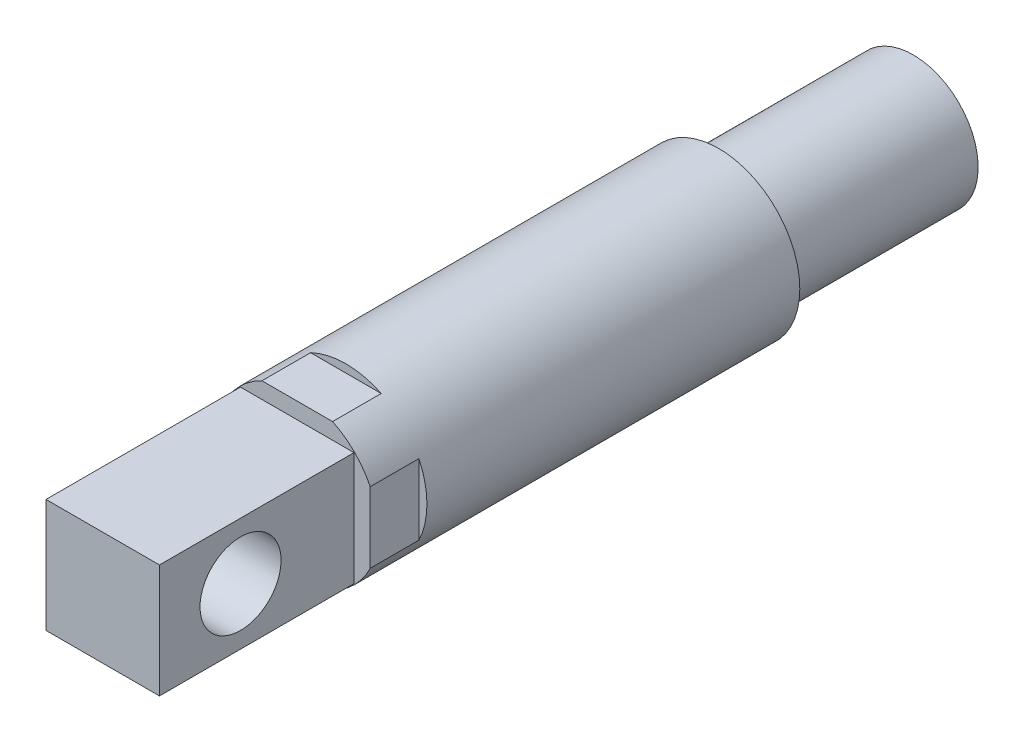
ISO-10303-21;
HEADER;
FILE_DESCRIPTION(('STEP AP214'),'2;1');
FILE_NAME('part.step','',(''),(''),'','','');
FILE_SCHEMA(('AUTOMOTIVE_DESIGN { 1 0 10303 214 1 1 1 1 }'));
ENDSEC;
DATA;
#1=APPLICATION_CONTEXT('core data for automotive mechanical design processes');
#2=APPLICATION_PROTOCOL_DEFINITION('international standard','automotive_design',2000,#1);
#3=PRODUCT_CONTEXT('',#1,'mechanical');
#4=PRODUCT('Part','Part','',(#3));
#5=PRODUCT_RELATED_PRODUCT_CATEGORY('part','',(#4));
#6=PRODUCT_DEFINITION_FORMATION('','',#4);
#7=PRODUCT_DEFINITION_CONTEXT('part definition',#1,'design');
#8=PRODUCT_DEFINITION('design','',#6,#7);
#9=PRODUCT_DEFINITION_SHAPE('','',#8);
#10=(LENGTH_UNIT() NAMED_UNIT(*) SI_UNIT(.MILLI.,.METRE.));
#11=(NAMED_UNIT(*) PLANE_ANGLE_UNIT() SI_UNIT($,.RADIAN.));
#12=(NAMED_UNIT(*) SI_UNIT($,.STERADIAN.) SOLID_ANGLE_UNIT());
#13=UNCERTAINTY_MEASURE_WITH_UNIT(LENGTH_MEASURE(1.E-05),#10,'distance_accuracy_value','');
#14=(GEOMETRIC_REPRESENTATION_CONTEXT(3) GLOBAL_UNCERTAINTY_ASSIGNED_CONTEXT((#13)) GLOBAL_UNIT_ASSIGNED_CONTEXT((#10,
#11,#12)) REPRESENTATION_CONTEXT('',''));
#15=CARTESIAN_POINT('',(0.,0.,0.));
#16=DIRECTION('',(0.,0.,1.));
#17=DIRECTION('',(1.,0.,0.));
#18=AXIS2_PLACEMENT_3D('',#15,#16,#17);
#19=CARTESIAN_POINT('',(-4.5,-4.5,30.));
#20=DIRECTION('',(0.,-1.,0.));
#21=DIRECTION('',(0.,0.,-1.));
#22=AXIS2_PLACEMENT_3D('',#19,#20,#21);
#23=PLANE('',#22);
#24=DIRECTION('',(0.,0.,-1.));
#25=VECTOR('',#24,1.);
#26=CARTESIAN_POINT('',(2.17944947177034,-4.5,70.));
#27=LINE('',#26,#25);
#28=CARTESIAN_POINT('',(2.17944947177034,-4.5,23.));
#29=VERTEX_POINT('',#28);
#30=CARTESIAN_POINT('',(2.17944947177034,-4.5,26.));
#31=VERTEX_POINT('',#30);
#32=EDGE_CURVE('E488',#29,#31,#27,.F.);
#33=ORIENTED_EDGE('',*,*,#32,.T.);
#34=DIRECTION('',(1.,0.,0.));
#35=VECTOR('',#34,1.);
#36=CARTESIAN_POINT('',(-4.5,-4.5,26.));
#37=LINE('',#36,#35);
#38=CARTESIAN_POINT('',(-2.17944947177034,-4.5,26.));
#39=VERTEX_POINT('',#38);
#40=EDGE_CURVE('E448',#39,#31,#37,.T.);
#41=ORIENTED_EDGE('',*,*,#40,.F.);
#42=DIRECTION('',(0.,0.,-1.));
#43=VECTOR('',#42,1.);
#44=CARTESIAN_POINT('',(-2.17944947177034,-4.5,70.));
#45=LINE('',#44,#43);
#46=CARTESIAN_POINT('',(-2.17944947177034,-4.5,23.));
#47=VERTEX_POINT('',#46);
#48=EDGE_CURVE('E485',#39,#47,#45,.T.);
#49=ORIENTED_EDGE('',*,*,#48,.T.);
#50=DIRECTION('',(1.,0.,0.));
#51=VECTOR('',#50,1.);
#52=CARTESIAN_POINT('',(-4.5,-4.5,23.));
#53=LINE('',#52,#51);
#54=EDGE_CURVE('E463',#47,#29,#53,.T.);
#55=ORIENTED_EDGE('',*,*,#54,.T.);
#56=EDGE_LOOP('',(#33,#41,#49,#55));
#57=FACE_BOUND('',#56,.T.);
#58=ADVANCED_FACE('F291',(#57),#23,.T.);
#59=CARTESIAN_POINT('',(4.5,-4.5,30.));
#60=DIRECTION('',(1.,0.,0.));
#61=DIRECTION('',(0.,0.,-1.));
#62=AXIS2_PLACEMENT_3D('',#59,#60,#61);
#63=PLANE('',#62);
#64=DIRECTION('',(0.,0.,-1.));
#65=VECTOR('',#64,1.);
#66=CARTESIAN_POINT('',(4.5,2.17944947177034,70.));
#67=LINE('',#66,#65);
#68=CARTESIAN_POINT('',(4.5,2.17944947177034,23.));
#69=VERTEX_POINT('',#68);
#70=CARTESIAN_POINT('',(4.5,2.17944947177034,26.));
#71=VERTEX_POINT('',#70);
#72=EDGE_CURVE('E481',#69,#71,#67,.F.);
#73=ORIENTED_EDGE('',*,*,#72,.T.);
#74=DIRECTION('',(0.,1.,0.));
#75=VECTOR('',#74,1.);
#76=CARTESIAN_POINT('',(4.5,4.5,26.));
#77=LINE('',#76,#75);
#78=CARTESIAN_POINT('',(4.5,-2.17944947177034,26.));
#79=VERTEX_POINT('',#78);
#80=EDGE_CURVE('E434',#79,#71,#77,.T.);
#81=ORIENTED_EDGE('',*,*,#80,.F.);
#82=DIRECTION('',(0.,0.,-1.));
#83=VECTOR('',#82,1.);
#84=CARTESIAN_POINT('',(4.5,-2.17944947177034,70.));
#85=LINE('',#84,#83);
#86=CARTESIAN_POINT('',(4.5,-2.17944947177034,23.));
#87=VERTEX_POINT('',#86);
#88=EDGE_CURVE('E478',#79,#87,#85,.T.);
#89=ORIENTED_EDGE('',*,*,#88,.T.);
#90=DIRECTION('',(0.,1.,0.));
#91=VECTOR('',#90,1.);
#92=CARTESIAN_POINT('',(4.5,-4.5,23.));
#93=LINE('',#92,#91);
#94=EDGE_CURVE('E451',#87,#69,#93,.T.);
#95=ORIENTED_EDGE('',*,*,#94,.T.);
#96=EDGE_LOOP('',(#73,#81,#89,#95));
#97=FACE_BOUND('',#96,.T.);
#98=ADVANCED_FACE('F533',(#97),#63,.T.);
#99=CARTESIAN_POINT('',(-4.5,4.5,30.));
#100=DIRECTION('',(0.,1.,0.));
#101=DIRECTION('',(0.,0.,1.));
#102=AXIS2_PLACEMENT_3D('',#99,#100,#101);
#103=PLANE('',#102);
#104=DIRECTION('',(0.,0.,-1.));
#105=VECTOR('',#104,1.);
#106=CARTESIAN_POINT('',(-2.17944947177034,4.5,70.));
#107=LINE('',#106,#105);
#108=CARTESIAN_POINT('',(-2.17944947177034,4.5,23.));
#109=VERTEX_POINT('',#108);
#110=CARTESIAN_POINT('',(-2.17944947177034,4.5,26.));
#111=VERTEX_POINT('',#110);
#112=EDGE_CURVE('E474',#109,#111,#107,.F.);
#113=ORIENTED_EDGE('',*,*,#112,.T.);
#114=DIRECTION('',(-1.,0.,0.));
#115=VECTOR('',#114,1.);
#116=CARTESIAN_POINT('',(-4.5,4.5,26.));
#117=LINE('',#116,#115);
#118=CARTESIAN_POINT('',(2.17944947177034,4.5,26.));
#119=VERTEX_POINT('',#118);
#120=EDGE_CURVE('E442',#119,#111,#117,.T.);
#121=ORIENTED_EDGE('',*,*,#120,.F.);
#122=DIRECTION('',(0.,0.,-1.));
#123=VECTOR('',#122,1.);
#124=CARTESIAN_POINT('',(2.17944947177034,4.5,70.));
#125=LINE('',#124,#123);
#126=CARTESIAN_POINT('',(2.17944947177034,4.5,23.));
#127=VERTEX_POINT('',#126);
#128=EDGE_CURVE('E473',#119,#127,#125,.T.);
#129=ORIENTED_EDGE('',*,*,#128,.T.);
#130=DIRECTION('',(-1.,0.,0.));
#131=VECTOR('',#130,1.);
#132=CARTESIAN_POINT('',(-4.5,4.5,23.));
#133=LINE('',#132,#131);
#134=EDGE_CURVE('E455',#127,#109,#133,.T.);
#135=ORIENTED_EDGE('',*,*,#134,.T.);
#136=EDGE_LOOP('',(#113,#121,#129,#135));
#137=FACE_BOUND('',#136,.T.);
#138=ADVANCED_FACE('F539',(#137),#103,.T.);
#139=CARTESIAN_POINT('',(-4.5,-4.5,30.));
#140=DIRECTION('',(-1.,0.,0.));
#141=DIRECTION('',(0.,0.,1.));
#142=AXIS2_PLACEMENT_3D('',#139,#140,#141);
#143=PLANE('',#142);
#144=DIRECTION('',(0.,0.,-1.));
#145=VECTOR('',#144,1.);
#146=CARTESIAN_POINT('',(-4.5,-2.17944947177034,70.));
#147=LINE('',#146,#145);
#148=CARTESIAN_POINT('',(-4.5,-2.17944947177034,23.));
#149=VERTEX_POINT('',#148);
#150=CARTESIAN_POINT('',(-4.5,-2.17944947177034,26.));
#151=VERTEX_POINT('',#150);
#152=EDGE_CURVE('E469',#149,#151,#147,.F.);
#153=ORIENTED_EDGE('',*,*,#152,.T.);
#154=DIRECTION('',(0.,-1.,0.));
#155=VECTOR('',#154,1.);
#156=CARTESIAN_POINT('',(-4.5,4.5,26.));
#157=LINE('',#156,#155);
#158=CARTESIAN_POINT('',(-4.5,2.17944947177034,26.));
#159=VERTEX_POINT('',#158);
#160=EDGE_CURVE('E445',#159,#151,#157,.T.);
#161=ORIENTED_EDGE('',*,*,#160,.F.);
#162=DIRECTION('',(0.,0.,-1.));
#163=VECTOR('',#162,1.);
#164=CARTESIAN_POINT('',(-4.5,2.17944947177034,70.));
#165=LINE('',#164,#163);
#166=CARTESIAN_POINT('',(-4.5,2.17944947177034,23.));
#167=VERTEX_POINT('',#166);
#168=EDGE_CURVE('E466',#159,#167,#165,.T.);
#169=ORIENTED_EDGE('',*,*,#168,.T.);
#170=DIRECTION('',(0.,-1.,0.));
#171=VECTOR('',#170,1.);
#172=CARTESIAN_POINT('',(-4.5,-4.5,23.));
#173=LINE('',#172,#171);
#174=EDGE_CURVE('E459',#167,#149,#173,.T.);
#175=ORIENTED_EDGE('',*,*,#174,.T.);
#176=EDGE_LOOP('',(#153,#161,#169,#175));
#177=FACE_BOUND('',#176,.T.);
#178=ADVANCED_FACE('F528',(#177),#143,.T.);
#179=CARTESIAN_POINT('',(0.,0.,70.));
#180=DIRECTION('',(0.,0.,-1.));
#181=DIRECTION('',(-1.,0.,0.));
#182=AXIS2_PLACEMENT_3D('',#179,#180,#181);
#183=CYLINDRICAL_SURFACE('',#182,5.);
#184=CARTESIAN_POINT('',(0.,0.,0.));
#185=DIRECTION('',(0.,0.,1.));
#186=DIRECTION('',(1.,0.,0.));
#187=AXIS2_PLACEMENT_3D('',#184,#185,#186);
#188=CIRCLE('',#187,5.);
#189=CARTESIAN_POINT('',(5.,0.,0.));
#190=VERTEX_POINT('',#189);
#191=EDGE_CURVE('E492',#190,#190,#188,.T.);
#192=ORIENTED_EDGE('',*,*,#191,.T.);
#193=EDGE_LOOP('',(#192));
#194=FACE_BOUND('',#193,.T.);
#195=CARTESIAN_POINT('',(0.,0.,26.));
#196=DIRECTION('',(0.,0.,1.));
#197=DIRECTION('',(1.,0.,0.));
#198=AXIS2_PLACEMENT_3D('',#195,#196,#197);
#199=CIRCLE('',#198,5.);
#200=EDGE_CURVE('E12',#71,#119,#199,.T.);
#201=ORIENTED_EDGE('',*,*,#200,.F.);
#202=ORIENTED_EDGE('',*,*,#72,.F.);
#203=CARTESIAN_POINT('',(0.,0.,23.));
#204=DIRECTION('',(0.,0.,-1.));
#205=DIRECTION('',(-1.,0.,0.));
#206=AXIS2_PLACEMENT_3D('',#203,#204,#205);
#207=CIRCLE('',#206,5.);
#208=EDGE_CURVE('E502',#69,#87,#207,.T.);
#209=ORIENTED_EDGE('',*,*,#208,.T.);
#210=ORIENTED_EDGE('',*,*,#88,.F.);
#211=EDGE_CURVE('E302',#31,#79,#199,.T.);
#212=ORIENTED_EDGE('',*,*,#211,.F.);
#213=ORIENTED_EDGE('',*,*,#32,.F.);
#214=EDGE_CURVE('E316',#29,#47,#207,.T.);
#215=ORIENTED_EDGE('',*,*,#214,.T.);
#216=ORIENTED_EDGE('',*,*,#48,.F.);
#217=EDGE_CURVE('E504',#151,#39,#199,.T.);
#218=ORIENTED_EDGE('',*,*,#217,.F.);
#219=ORIENTED_EDGE('',*,*,#152,.F.);
#220=EDGE_CURVE('E501',#149,#167,#207,.T.);
#221=ORIENTED_EDGE('',*,*,#220,.T.);
#222=ORIENTED_EDGE('',*,*,#168,.F.);
#223=EDGE_CURVE('E301',#111,#159,#199,.T.);
#224=ORIENTED_EDGE('',*,*,#223,.F.);
#225=ORIENTED_EDGE('',*,*,#112,.F.);
#226=EDGE_CURVE('E498',#109,#127,#207,.T.);
#227=ORIENTED_EDGE('',*,*,#226,.T.);
#228=ORIENTED_EDGE('',*,*,#128,.F.);
#229=EDGE_LOOP('',(#201,#202,#209,#210,#212,#213,#215,#216,#218,#219,#221,#222,#224,#225,#227,#228));
#230=FACE_BOUND('',#229,.T.);
#231=ADVANCED_FACE('F293',(#194,#230),#183,.T.);
#232=CARTESIAN_POINT('',(0.,0.,0.));
#233=DIRECTION('',(0.,0.,1.));
#234=DIRECTION('',(1.,0.,0.));
#235=AXIS2_PLACEMENT_3D('',#232,#233,#234);
#236=PLANE('',#235);
#237=CARTESIAN_POINT('',(0.,0.,0.));
#238=DIRECTION('',(0.,0.,-1.));
#239=DIRECTION('',(-1.,0.,0.));
#240=AXIS2_PLACEMENT_3D('',#237,#238,#239);
#241=CIRCLE('',#240,4.);
#242=CARTESIAN_POINT('',(-4.,0.,0.));
#243=VERTEX_POINT('',#242);
#244=EDGE_CURVE('E583',#243,#243,#241,.T.);
#245=ORIENTED_EDGE('',*,*,#244,.F.);
#246=EDGE_LOOP('',(#245));
#247=FACE_BOUND('',#246,.T.);
#248=ORIENTED_EDGE('',*,*,#191,.F.);
#249=EDGE_LOOP('',(#248));
#250=FACE_BOUND('',#249,.T.);
#251=ADVANCED_FACE('F544',(#247,#250),#236,.F.);
#252=CARTESIAN_POINT('',(0.,0.,23.));
#253=DIRECTION('',(0.,0.,-1.));
#254=DIRECTION('',(-1.,0.,0.));
#255=AXIS2_PLACEMENT_3D('',#252,#253,#254);
#256=PLANE('',#255);
#257=ORIENTED_EDGE('',*,*,#134,.F.);
#258=ORIENTED_EDGE('',*,*,#226,.F.);
#259=EDGE_LOOP('',(#257,#258));
#260=FACE_BOUND('',#259,.T.);
#261=ADVANCED_FACE('F542',(#260),#256,.F.);
#262=ORIENTED_EDGE('',*,*,#220,.F.);
#263=ORIENTED_EDGE('',*,*,#174,.F.);
#264=EDGE_LOOP('',(#262,#263));
#265=FACE_BOUND('',#264,.T.);
#266=ADVANCED_FACE('F526',(#265),#256,.F.);
#267=ORIENTED_EDGE('',*,*,#54,.F.);
#268=ORIENTED_EDGE('',*,*,#214,.F.);
#269=EDGE_LOOP('',(#267,#268));
#270=FACE_BOUND('',#269,.T.);
#271=ADVANCED_FACE('F551',(#270),#256,.F.);
#272=ORIENTED_EDGE('',*,*,#94,.F.);
#273=ORIENTED_EDGE('',*,*,#208,.F.);
#274=EDGE_LOOP('',(#272,#273));
#275=FACE_BOUND('',#274,.T.);
#276=ADVANCED_FACE('F546',(#275),#256,.F.);
#277=CARTESIAN_POINT('',(0.,0.,26.));
#278=DIRECTION('',(0.,0.,1.));
#279=DIRECTION('',(1.,0.,0.));
#280=AXIS2_PLACEMENT_3D('',#277,#278,#279);
#281=PLANE('',#280);
#282=DIRECTION('',(1.,0.,0.));
#283=VECTOR('',#282,1.);
#284=CARTESIAN_POINT('',(-3.5,-3.5,26.));
#285=LINE('',#284,#283);
#286=CARTESIAN_POINT('',(-3.5,-3.5,26.));
#287=VERTEX_POINT('',#286);
#288=CARTESIAN_POINT('',(3.5,-3.5,26.));
#289=VERTEX_POINT('',#288);
#290=EDGE_CURVE('E396',#287,#289,#285,.T.);
#291=ORIENTED_EDGE('',*,*,#290,.F.);
#292=DIRECTION('',(0.,-1.,0.));
#293=VECTOR('',#292,1.);
#294=CARTESIAN_POINT('',(-3.5,3.5,26.));
#295=LINE('',#294,#293);
#296=CARTESIAN_POINT('',(-3.5,3.5,26.));
#297=VERTEX_POINT('',#296);
#298=EDGE_CURVE('E406',#297,#287,#295,.T.);
#299=ORIENTED_EDGE('',*,*,#298,.F.);
#300=DIRECTION('',(-1.,0.,0.));
#301=VECTOR('',#300,1.);
#302=CARTESIAN_POINT('',(-3.5,3.5,26.));
#303=LINE('',#302,#301);
#304=CARTESIAN_POINT('',(3.5,3.5,26.));
#305=VERTEX_POINT('',#304);
#306=EDGE_CURVE('E387',#305,#297,#303,.T.);
#307=ORIENTED_EDGE('',*,*,#306,.F.);
#308=DIRECTION('',(0.,1.,0.));
#309=VECTOR('',#308,1.);
#310=CARTESIAN_POINT('',(3.5,3.5,26.));
#311=LINE('',#310,#309);
#312=EDGE_CURVE('E403',#289,#305,#311,.T.);
#313=ORIENTED_EDGE('',*,*,#312,.F.);
#314=EDGE_LOOP('',(#291,#299,#307,#313));
#315=FACE_BOUND('',#314,.T.);
#316=ORIENTED_EDGE('',*,*,#200,.T.);
#317=ORIENTED_EDGE('',*,*,#120,.T.);
#318=ORIENTED_EDGE('',*,*,#223,.T.);
#319=ORIENTED_EDGE('',*,*,#160,.T.);
#320=ORIENTED_EDGE('',*,*,#217,.T.);
#321=ORIENTED_EDGE('',*,*,#40,.T.);
#322=ORIENTED_EDGE('',*,*,#211,.T.);
#323=ORIENTED_EDGE('',*,*,#80,.T.);
#324=EDGE_LOOP('',(#316,#317,#318,#319,#320,#321,#322,#323));
#325=FACE_BOUND('',#324,.T.);
#326=ADVANCED_FACE('F401',(#315,#325),#281,.T.);
#327=CARTESIAN_POINT('',(3.5,3.5,26.));
#328=DIRECTION('',(1.,0.,0.));
#329=DIRECTION('',(0.,1.,0.));
#330=AXIS2_PLACEMENT_3D('',#327,#328,#329);
#331=PLANE('',#330);
#332=CARTESIAN_POINT('',(3.5,0.,33.));
#333=DIRECTION('',(1.,0.,0.));
#334=DIRECTION('',(0.,1.,0.));
#335=AXIS2_PLACEMENT_3D('',#332,#333,#334);
#336=CIRCLE('',#335,2.5);
#337=CARTESIAN_POINT('',(3.5,2.5,33.));
#338=VERTEX_POINT('',#337);
#339=EDGE_CURVE('E418',#338,#338,#336,.T.);
#340=ORIENTED_EDGE('',*,*,#339,.F.);
#341=EDGE_LOOP('',(#340));
#342=FACE_BOUND('',#341,.T.);
#343=DIRECTION('',(0.,1.,0.));
#344=VECTOR('',#343,1.);
#345=CARTESIAN_POINT('',(3.5,3.5,38.));
#346=LINE('',#345,#344);
#347=CARTESIAN_POINT('',(3.5,-3.5,38.));
#348=VERTEX_POINT('',#347);
#349=CARTESIAN_POINT('',(3.5,3.5,38.));
#350=VERTEX_POINT('',#349);
#351=EDGE_CURVE('E425',#348,#350,#346,.T.);
#352=ORIENTED_EDGE('',*,*,#351,.F.);
#353=DIRECTION('',(0.,0.,1.));
#354=VECTOR('',#353,1.);
#355=CARTESIAN_POINT('',(3.5,-3.5,26.));
#356=LINE('',#355,#354);
#357=EDGE_CURVE('E410',#289,#348,#356,.T.);
#358=ORIENTED_EDGE('',*,*,#357,.F.);
#359=ORIENTED_EDGE('',*,*,#312,.T.);
#360=DIRECTION('',(0.,0.,1.));
#361=VECTOR('',#360,1.);
#362=CARTESIAN_POINT('',(3.5,3.5,26.));
#363=LINE('',#362,#361);
#364=EDGE_CURVE('E384',#305,#350,#363,.T.);
#365=ORIENTED_EDGE('',*,*,#364,.T.);
#366=EDGE_LOOP('',(#352,#358,#359,#365));
#367=FACE_BOUND('',#366,.T.);
#368=ADVANCED_FACE('F409',(#342,#367),#331,.T.);
#369=CARTESIAN_POINT('',(-3.5,-3.5,26.));
#370=DIRECTION('',(0.,-1.,0.));
#371=DIRECTION('',(0.,0.,-1.));
#372=AXIS2_PLACEMENT_3D('',#369,#370,#371);
#373=PLANE('',#372);
#374=DIRECTION('',(1.,0.,0.));
#375=VECTOR('',#374,1.);
#376=CARTESIAN_POINT('',(-3.5,-3.5,38.));
#377=LINE('',#376,#375);
#378=CARTESIAN_POINT('',(-3.5,-3.5,38.));
#379=VERTEX_POINT('',#378);
#380=EDGE_CURVE('E412',#379,#348,#377,.T.);
#381=ORIENTED_EDGE('',*,*,#380,.F.);
#382=DIRECTION('',(0.,0.,1.));
#383=VECTOR('',#382,1.);
#384=CARTESIAN_POINT('',(-3.5,-3.5,26.));
#385=LINE('',#384,#383);
#386=EDGE_CURVE('E435',#287,#379,#385,.T.);
#387=ORIENTED_EDGE('',*,*,#386,.F.);
#388=ORIENTED_EDGE('',*,*,#290,.T.);
#389=ORIENTED_EDGE('',*,*,#357,.T.);
#390=EDGE_LOOP('',(#381,#387,#388,#389));
#391=FACE_BOUND('',#390,.T.);
#392=ADVANCED_FACE('F599',(#391),#373,.T.);
#393=CARTESIAN_POINT('',(-3.5,3.5,26.));
#394=DIRECTION('',(-1.,0.,0.));
#395=DIRECTION('',(0.,-1.,0.));
#396=AXIS2_PLACEMENT_3D('',#393,#394,#395);
#397=PLANE('',#396);
#398=CARTESIAN_POINT('',(-3.5,0.,33.));
#399=DIRECTION('',(-1.,0.,0.));
#400=DIRECTION('',(0.,-1.,0.));
#401=AXIS2_PLACEMENT_3D('',#398,#399,#400);
#402=CIRCLE('',#401,2.5);
#403=CARTESIAN_POINT('',(-3.5,-2.5,33.));
#404=VERTEX_POINT('',#403);
#405=EDGE_CURVE('E295',#404,#404,#402,.T.);
#406=ORIENTED_EDGE('',*,*,#405,.F.);
#407=EDGE_LOOP('',(#406));
#408=FACE_BOUND('',#407,.T.);
#409=DIRECTION('',(0.,-1.,0.));
#410=VECTOR('',#409,1.);
#411=CARTESIAN_POINT('',(-3.5,3.5,38.));
#412=LINE('',#411,#410);
#413=CARTESIAN_POINT('',(-3.5,3.5,38.));
#414=VERTEX_POINT('',#413);
#415=EDGE_CURVE('E309',#414,#379,#412,.T.);
#416=ORIENTED_EDGE('',*,*,#415,.F.);
#417=DIRECTION('',(0.,0.,1.));
#418=VECTOR('',#417,1.);
#419=CARTESIAN_POINT('',(-3.5,3.5,26.));
#420=LINE('',#419,#418);
#421=EDGE_CURVE('E395',#297,#414,#420,.T.);
#422=ORIENTED_EDGE('',*,*,#421,.F.);
#423=ORIENTED_EDGE('',*,*,#298,.T.);
#424=ORIENTED_EDGE('',*,*,#386,.T.);
#425=EDGE_LOOP('',(#416,#422,#423,#424));
#426=FACE_BOUND('',#425,.T.);
#427=ADVANCED_FACE('F597',(#408,#426),#397,.T.);
#428=CARTESIAN_POINT('',(-3.5,3.5,26.));
#429=DIRECTION('',(0.,1.,0.));
#430=DIRECTION('',(0.,0.,1.));
#431=AXIS2_PLACEMENT_3D('',#428,#429,#430);
#432=PLANE('',#431);
#433=DIRECTION('',(-1.,0.,0.));
#434=VECTOR('',#433,1.);
#435=CARTESIAN_POINT('',(-3.5,3.5,38.));
#436=LINE('',#435,#434);
#437=EDGE_CURVE('E389',#350,#414,#436,.T.);
#438=ORIENTED_EDGE('',*,*,#437,.F.);
#439=ORIENTED_EDGE('',*,*,#364,.F.);
#440=ORIENTED_EDGE('',*,*,#306,.T.);
#441=ORIENTED_EDGE('',*,*,#421,.T.);
#442=EDGE_LOOP('',(#438,#439,#440,#441));
#443=FACE_BOUND('',#442,.T.);
#444=ADVANCED_FACE('F386',(#443),#432,.T.);
#445=CARTESIAN_POINT('',(0.,0.,38.));
#446=DIRECTION('',(0.,0.,1.));
#447=DIRECTION('',(1.,0.,0.));
#448=AXIS2_PLACEMENT_3D('',#445,#446,#447);
#449=PLANE('',#448);
#450=ORIENTED_EDGE('',*,*,#380,.T.);
#451=ORIENTED_EDGE('',*,*,#351,.T.);
#452=ORIENTED_EDGE('',*,*,#437,.T.);
#453=ORIENTED_EDGE('',*,*,#415,.T.);
#454=EDGE_LOOP('',(#450,#451,#452,#453));
#455=FACE_BOUND('',#454,.T.);
#456=ADVANCED_FACE('F606',(#455),#449,.T.);
#457=CARTESIAN_POINT('',(-8.5,0.,33.));
#458=DIRECTION('',(1.,0.,0.));
#459=DIRECTION('',(0.,1.,0.));
#460=AXIS2_PLACEMENT_3D('',#457,#458,#459);
#461=CYLINDRICAL_SURFACE('',#460,2.5);
#462=ORIENTED_EDGE('',*,*,#405,.T.);
#463=EDGE_LOOP('',(#462));
#464=FACE_BOUND('',#463,.T.);
#465=ORIENTED_EDGE('',*,*,#339,.T.);
#466=EDGE_LOOP('',(#465));
#467=FACE_BOUND('',#466,.T.);
#468=ADVANCED_FACE('F575',(#464,#467),#461,.F.);
#469=CARTESIAN_POINT('',(0.,0.,0.));
#470=DIRECTION('',(0.,0.,-1.));
#471=DIRECTION('',(-1.,0.,0.));
#472=AXIS2_PLACEMENT_3D('',#469,#470,#471);
#473=CYLINDRICAL_SURFACE('',#472,4.);
#474=ORIENTED_EDGE('',*,*,#244,.T.);
#475=EDGE_LOOP('',(#474));
#476=FACE_BOUND('',#475,.T.);
#477=CARTESIAN_POINT('',(0.,0.,-12.));
#478=DIRECTION('',(0.,0.,-1.));
#479=DIRECTION('',(-1.,0.,0.));
#480=AXIS2_PLACEMENT_3D('',#477,#478,#479);
#481=CIRCLE('',#480,4.);
#482=CARTESIAN_POINT('',(-4.,0.,-12.));
#483=VERTEX_POINT('',#482);
#484=EDGE_CURVE('E580',#483,#483,#481,.T.);
#485=ORIENTED_EDGE('',*,*,#484,.F.);
#486=EDGE_LOOP('',(#485));
#487=FACE_BOUND('',#486,.T.);
#488=ADVANCED_FACE('F570',(#476,#487),#473,.T.);
#489=CARTESIAN_POINT('',(0.,0.,-12.));
#490=DIRECTION('',(0.,0.,-1.));
#491=DIRECTION('',(-1.,0.,0.));
#492=AXIS2_PLACEMENT_3D('',#489,#490,#491);
#493=PLANE('',#492);
#494=ORIENTED_EDGE('',*,*,#484,.T.);
#495=EDGE_LOOP('',(#494));
#496=FACE_BOUND('',#495,.T.);
#497=ADVANCED_FACE('F568',(#496),#493,.T.);
#498=CLOSED_SHELL('',(#58,#98,#138,#178,#231,#251,#261,#266,#271,#276,#326,#368,#392,#427,#444,
#456,#468,#488,#497));
#499=MANIFOLD_SOLID_BREP('B2',#498);
#500=ADVANCED_BREP_SHAPE_REPRESENTATION('',(#18,#499),#14);
#501=SHAPE_DEFINITION_REPRESENTATION(#9,#500);
ENDSEC;
END-ISO-10303-21;
